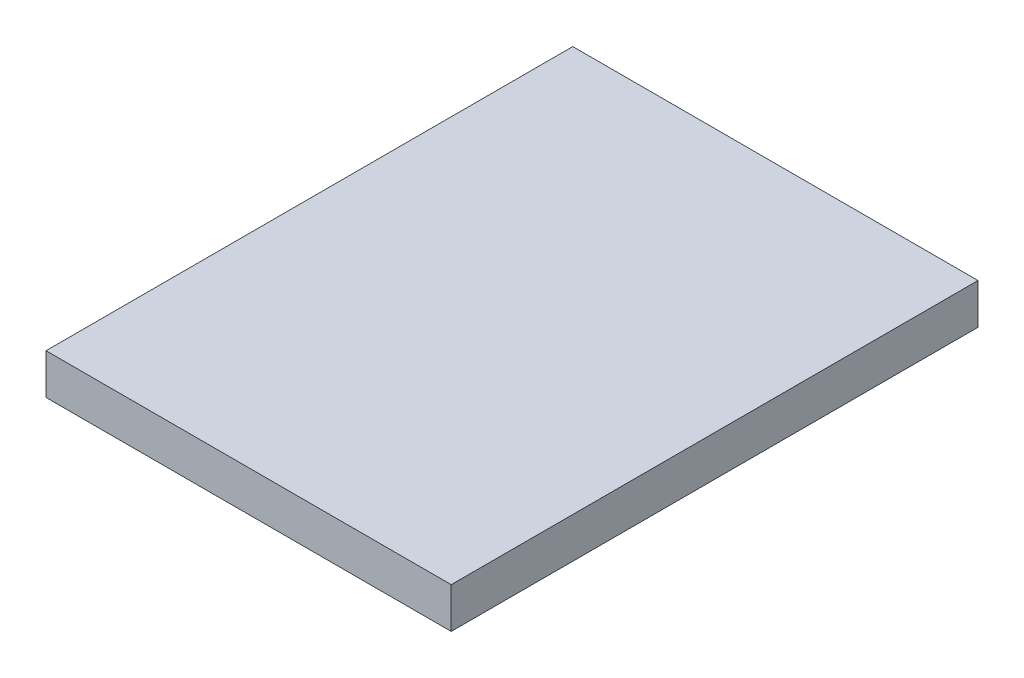
ISO-10303-21;
HEADER;
FILE_DESCRIPTION(('STEP AP214'),'2;1');
FILE_NAME('part.step','',(''),(''),'','','');
FILE_SCHEMA(('AUTOMOTIVE_DESIGN { 1 0 10303 214 1 1 1 1 }'));
ENDSEC;
DATA;
#1=APPLICATION_CONTEXT('core data for automotive mechanical design processes');
#2=APPLICATION_PROTOCOL_DEFINITION('international standard','automotive_design',2000,#1);
#3=PRODUCT_CONTEXT('',#1,'mechanical');
#4=PRODUCT('Part','Part','',(#3));
#5=PRODUCT_RELATED_PRODUCT_CATEGORY('part','',(#4));
#6=PRODUCT_DEFINITION_FORMATION('','',#4);
#7=PRODUCT_DEFINITION_CONTEXT('part definition',#1,'design');
#8=PRODUCT_DEFINITION('design','',#6,#7);
#9=PRODUCT_DEFINITION_SHAPE('','',#8);
#10=(LENGTH_UNIT() NAMED_UNIT(*) SI_UNIT(.MILLI.,.METRE.));
#11=(NAMED_UNIT(*) PLANE_ANGLE_UNIT() SI_UNIT($,.RADIAN.));
#12=(NAMED_UNIT(*) SI_UNIT($,.STERADIAN.) SOLID_ANGLE_UNIT());
#13=UNCERTAINTY_MEASURE_WITH_UNIT(LENGTH_MEASURE(1.E-05),#10,'distance_accuracy_value','');
#14=(GEOMETRIC_REPRESENTATION_CONTEXT(3) GLOBAL_UNCERTAINTY_ASSIGNED_CONTEXT((#13)) GLOBAL_UNIT_ASSIGNED_CONTEXT((#10,
#11,#12)) REPRESENTATION_CONTEXT('',''));
#15=CARTESIAN_POINT('',(0.,0.,0.));
#16=DIRECTION('',(0.,0.,1.));
#17=DIRECTION('',(1.,0.,0.));
#18=AXIS2_PLACEMENT_3D('',#15,#16,#17);
#19=CARTESIAN_POINT('',(0.,6.35,0.));
#20=DIRECTION('',(1.,0.,0.));
#21=DIRECTION('',(0.,0.,-1.));
#22=AXIS2_PLACEMENT_3D('',#19,#20,#21);
#23=PLANE('',#22);
#24=DIRECTION('',(0.,0.,1.));
#25=VECTOR('',#24,1.);
#26=CARTESIAN_POINT('',(0.,0.,0.));
#27=LINE('',#26,#25);
#28=CARTESIAN_POINT('',(0.,0.,-82.55));
#29=VERTEX_POINT('',#28);
#30=CARTESIAN_POINT('',(0.,0.,0.));
#31=VERTEX_POINT('',#30);
#32=EDGE_CURVE('E113',#29,#31,#27,.T.);
#33=ORIENTED_EDGE('',*,*,#32,.T.);
#34=DIRECTION('',(0.,-1.,0.));
#35=VECTOR('',#34,1.);
#36=CARTESIAN_POINT('',(0.,6.35,0.));
#37=LINE('',#36,#35);
#38=CARTESIAN_POINT('',(0.,6.35,0.));
#39=VERTEX_POINT('',#38);
#40=EDGE_CURVE('E11',#39,#31,#37,.T.);
#41=ORIENTED_EDGE('',*,*,#40,.F.);
#42=DIRECTION('',(0.,0.,1.));
#43=VECTOR('',#42,1.);
#44=CARTESIAN_POINT('',(0.,6.35,0.));
#45=LINE('',#44,#43);
#46=CARTESIAN_POINT('',(0.,6.35,-82.55));
#47=VERTEX_POINT('',#46);
#48=EDGE_CURVE('E97',#47,#39,#45,.T.);
#49=ORIENTED_EDGE('',*,*,#48,.F.);
#50=DIRECTION('',(0.,-1.,0.));
#51=VECTOR('',#50,1.);
#52=CARTESIAN_POINT('',(0.,6.35,-82.55));
#53=LINE('',#52,#51);
#54=EDGE_CURVE('E109',#47,#29,#53,.T.);
#55=ORIENTED_EDGE('',*,*,#54,.T.);
#56=EDGE_LOOP('',(#33,#41,#49,#55));
#57=FACE_BOUND('',#56,.T.);
#58=ADVANCED_FACE('F45',(#57),#23,.F.);
#59=CARTESIAN_POINT('',(0.,6.35,0.));
#60=DIRECTION('',(0.,0.,-1.));
#61=DIRECTION('',(-1.,0.,0.));
#62=AXIS2_PLACEMENT_3D('',#59,#60,#61);
#63=PLANE('',#62);
#64=DIRECTION('',(1.,0.,0.));
#65=VECTOR('',#64,1.);
#66=CARTESIAN_POINT('',(0.,0.,0.));
#67=LINE('',#66,#65);
#68=CARTESIAN_POINT('',(63.5,0.,0.));
#69=VERTEX_POINT('',#68);
#70=EDGE_CURVE('E102',#31,#69,#67,.T.);
#71=ORIENTED_EDGE('',*,*,#70,.T.);
#72=DIRECTION('',(0.,-1.,0.));
#73=VECTOR('',#72,1.);
#74=CARTESIAN_POINT('',(63.5,6.35,0.));
#75=LINE('',#74,#73);
#76=CARTESIAN_POINT('',(63.5,6.35,0.));
#77=VERTEX_POINT('',#76);
#78=EDGE_CURVE('E54',#77,#69,#75,.T.);
#79=ORIENTED_EDGE('',*,*,#78,.F.);
#80=DIRECTION('',(1.,0.,0.));
#81=VECTOR('',#80,1.);
#82=CARTESIAN_POINT('',(0.,6.35,0.));
#83=LINE('',#82,#81);
#84=EDGE_CURVE('E92',#39,#77,#83,.T.);
#85=ORIENTED_EDGE('',*,*,#84,.F.);
#86=ORIENTED_EDGE('',*,*,#40,.T.);
#87=EDGE_LOOP('',(#71,#79,#85,#86));
#88=FACE_BOUND('',#87,.T.);
#89=ADVANCED_FACE('F101',(#88),#63,.F.);
#90=CARTESIAN_POINT('',(63.5,6.35,0.));
#91=DIRECTION('',(-1.,0.,0.));
#92=DIRECTION('',(0.,0.,1.));
#93=AXIS2_PLACEMENT_3D('',#90,#91,#92);
#94=PLANE('',#93);
#95=DIRECTION('',(0.,0.,-1.));
#96=VECTOR('',#95,1.);
#97=CARTESIAN_POINT('',(63.5,0.,0.));
#98=LINE('',#97,#96);
#99=CARTESIAN_POINT('',(63.5,0.,-82.55));
#100=VERTEX_POINT('',#99);
#101=EDGE_CURVE('E79',#69,#100,#98,.T.);
#102=ORIENTED_EDGE('',*,*,#101,.T.);
#103=DIRECTION('',(0.,-1.,0.));
#104=VECTOR('',#103,1.);
#105=CARTESIAN_POINT('',(63.5,6.35,-82.55));
#106=LINE('',#105,#104);
#107=CARTESIAN_POINT('',(63.5,6.35,-82.55));
#108=VERTEX_POINT('',#107);
#109=EDGE_CURVE('E104',#108,#100,#106,.T.);
#110=ORIENTED_EDGE('',*,*,#109,.F.);
#111=DIRECTION('',(0.,0.,-1.));
#112=VECTOR('',#111,1.);
#113=CARTESIAN_POINT('',(63.5,6.35,0.));
#114=LINE('',#113,#112);
#115=EDGE_CURVE('E95',#77,#108,#114,.T.);
#116=ORIENTED_EDGE('',*,*,#115,.F.);
#117=ORIENTED_EDGE('',*,*,#78,.T.);
#118=EDGE_LOOP('',(#102,#110,#116,#117));
#119=FACE_BOUND('',#118,.T.);
#120=ADVANCED_FACE('F105',(#119),#94,.F.);
#121=CARTESIAN_POINT('',(0.,6.35,-82.55));
#122=DIRECTION('',(0.,0.,1.));
#123=DIRECTION('',(1.,0.,0.));
#124=AXIS2_PLACEMENT_3D('',#121,#122,#123);
#125=PLANE('',#124);
#126=DIRECTION('',(-1.,0.,0.));
#127=VECTOR('',#126,1.);
#128=CARTESIAN_POINT('',(0.,0.,-82.55));
#129=LINE('',#128,#127);
#130=EDGE_CURVE('E85',#100,#29,#129,.T.);
#131=ORIENTED_EDGE('',*,*,#130,.T.);
#132=ORIENTED_EDGE('',*,*,#54,.F.);
#133=DIRECTION('',(-1.,0.,0.));
#134=VECTOR('',#133,1.);
#135=CARTESIAN_POINT('',(0.,6.35,-82.55));
#136=LINE('',#135,#134);
#137=EDGE_CURVE('E62',#108,#47,#136,.T.);
#138=ORIENTED_EDGE('',*,*,#137,.F.);
#139=ORIENTED_EDGE('',*,*,#109,.T.);
#140=EDGE_LOOP('',(#131,#132,#138,#139));
#141=FACE_BOUND('',#140,.T.);
#142=ADVANCED_FACE('F126',(#141),#125,.F.);
#143=CARTESIAN_POINT('',(0.,6.35,0.));
#144=DIRECTION('',(0.,-1.,0.));
#145=DIRECTION('',(0.,0.,-1.));
#146=AXIS2_PLACEMENT_3D('',#143,#144,#145);
#147=PLANE('',#146);
#148=ORIENTED_EDGE('',*,*,#48,.T.);
#149=ORIENTED_EDGE('',*,*,#84,.T.);
#150=ORIENTED_EDGE('',*,*,#115,.T.);
#151=ORIENTED_EDGE('',*,*,#137,.T.);
#152=EDGE_LOOP('',(#148,#149,#150,#151));
#153=FACE_BOUND('',#152,.T.);
#154=ADVANCED_FACE('F93',(#153),#147,.F.);
#155=CARTESIAN_POINT('',(0.,0.,0.));
#156=DIRECTION('',(0.,-1.,0.));
#157=DIRECTION('',(0.,0.,-1.));
#158=AXIS2_PLACEMENT_3D('',#155,#156,#157);
#159=PLANE('',#158);
#160=ORIENTED_EDGE('',*,*,#32,.F.);
#161=ORIENTED_EDGE('',*,*,#130,.F.);
#162=ORIENTED_EDGE('',*,*,#101,.F.);
#163=ORIENTED_EDGE('',*,*,#70,.F.);
#164=EDGE_LOOP('',(#160,#161,#162,#163));
#165=FACE_BOUND('',#164,.T.);
#166=ADVANCED_FACE('F129',(#165),#159,.T.);
#167=CLOSED_SHELL('',(#58,#89,#120,#142,#154,#166));
#168=MANIFOLD_SOLID_BREP('B2',#167);
#169=ADVANCED_BREP_SHAPE_REPRESENTATION('',(#18,#168),#14);
#170=SHAPE_DEFINITION_REPRESENTATION(#9,#169);
ENDSEC;
END-ISO-10303-21;
